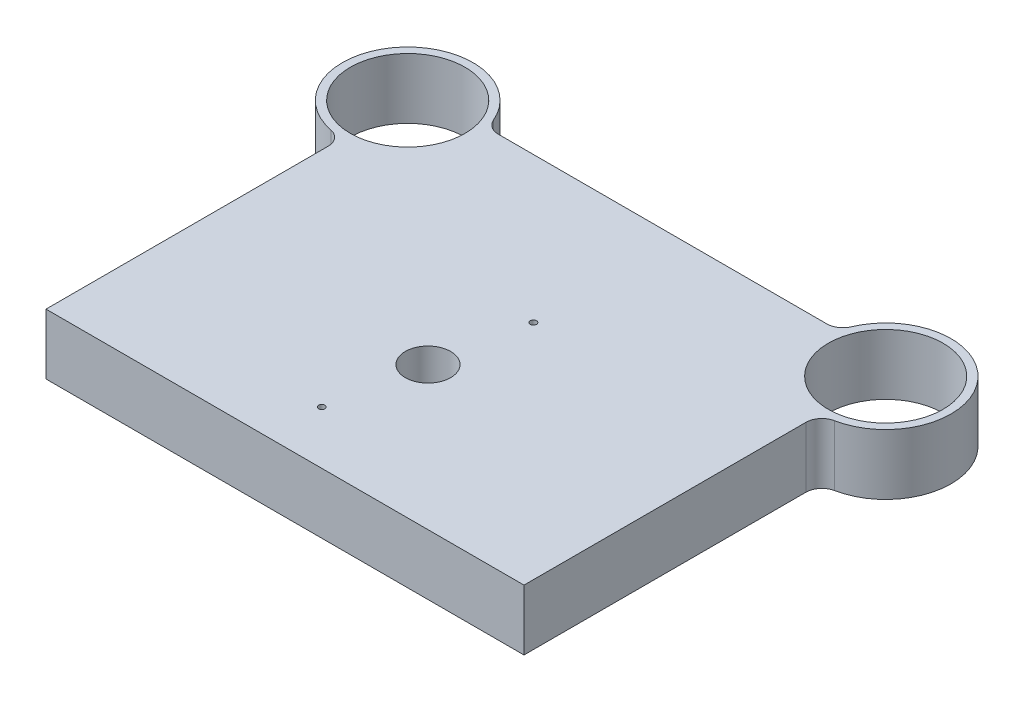
ISO-10303-21;
HEADER;
FILE_DESCRIPTION(('STEP AP214'),'2;1');
FILE_NAME('part.step','',(''),(''),'','','');
FILE_SCHEMA(('AUTOMOTIVE_DESIGN { 1 0 10303 214 1 1 1 1 }'));
ENDSEC;
DATA;
#1=APPLICATION_CONTEXT('core data for automotive mechanical design processes');
#2=APPLICATION_PROTOCOL_DEFINITION('international standard','automotive_design',2000,#1);
#3=PRODUCT_CONTEXT('',#1,'mechanical');
#4=PRODUCT('Part','Part','',(#3));
#5=PRODUCT_RELATED_PRODUCT_CATEGORY('part','',(#4));
#6=PRODUCT_DEFINITION_FORMATION('','',#4);
#7=PRODUCT_DEFINITION_CONTEXT('part definition',#1,'design');
#8=PRODUCT_DEFINITION('design','',#6,#7);
#9=PRODUCT_DEFINITION_SHAPE('','',#8);
#10=(LENGTH_UNIT() NAMED_UNIT(*) SI_UNIT(.MILLI.,.METRE.));
#11=(NAMED_UNIT(*) PLANE_ANGLE_UNIT() SI_UNIT($,.RADIAN.));
#12=(NAMED_UNIT(*) SI_UNIT($,.STERADIAN.) SOLID_ANGLE_UNIT());
#13=UNCERTAINTY_MEASURE_WITH_UNIT(LENGTH_MEASURE(1.E-05),#10,'distance_accuracy_value','');
#14=(GEOMETRIC_REPRESENTATION_CONTEXT(3) GLOBAL_UNCERTAINTY_ASSIGNED_CONTEXT((#13)) GLOBAL_UNIT_ASSIGNED_CONTEXT((#10,
#11,#12)) REPRESENTATION_CONTEXT('',''));
#15=CARTESIAN_POINT('',(0.,0.,0.));
#16=DIRECTION('',(0.,0.,1.));
#17=DIRECTION('',(1.,0.,0.));
#18=AXIS2_PLACEMENT_3D('',#15,#16,#17);
#19=CARTESIAN_POINT('',(-150.,38.,-227.));
#20=DIRECTION('',(0.,1.,0.));
#21=DIRECTION('',(0.,0.,1.));
#22=AXIS2_PLACEMENT_3D('',#19,#20,#21);
#23=PLANE('',#22);
#24=CARTESIAN_POINT('',(0.,38.,-89.74));
#25=DIRECTION('',(0.,1.,0.));
#26=DIRECTION('',(0.,0.,1.));
#27=AXIS2_PLACEMENT_3D('',#24,#25,#26);
#28=CIRCLE('',#27,14.25);
#29=CARTESIAN_POINT('',(0.,38.,-75.49));
#30=VERTEX_POINT('',#29);
#31=EDGE_CURVE('E384',#30,#30,#28,.T.);
#32=ORIENTED_EDGE('',*,*,#31,.F.);
#33=EDGE_LOOP('',(#32));
#34=FACE_BOUND('',#33,.T.);
#35=CARTESIAN_POINT('',(-10.25,38.,-33.3));
#36=DIRECTION('',(0.,1.,0.));
#37=DIRECTION('',(0.,0.,1.));
#38=AXIS2_PLACEMENT_3D('',#35,#36,#37);
#39=CIRCLE('',#38,1.99);
#40=CARTESIAN_POINT('',(-10.25,38.,-31.31));
#41=VERTEX_POINT('',#40);
#42=EDGE_CURVE('E164',#41,#41,#39,.T.);
#43=ORIENTED_EDGE('',*,*,#42,.F.);
#44=EDGE_LOOP('',(#43));
#45=FACE_BOUND('',#44,.T.);
#46=CARTESIAN_POINT('',(10.25,38.,-145.68));
#47=DIRECTION('',(0.,1.,0.));
#48=DIRECTION('',(0.,0.,1.));
#49=AXIS2_PLACEMENT_3D('',#46,#47,#48);
#50=CIRCLE('',#49,1.99000000000003);
#51=CARTESIAN_POINT('',(10.25,38.,-143.69));
#52=VERTEX_POINT('',#51);
#53=EDGE_CURVE('E159',#52,#52,#50,.T.);
#54=ORIENTED_EDGE('',*,*,#53,.F.);
#55=EDGE_LOOP('',(#54));
#56=FACE_BOUND('',#55,.T.);
#57=CARTESIAN_POINT('',(-150.,38.,-227.));
#58=DIRECTION('',(0.,1.,0.));
#59=DIRECTION('',(0.,0.,1.));
#60=AXIS2_PLACEMENT_3D('',#57,#58,#59);
#61=CIRCLE('',#60,36.);
#62=CARTESIAN_POINT('',(-150.,38.,-191.));
#63=VERTEX_POINT('',#62);
#64=EDGE_CURVE('E178',#63,#63,#61,.T.);
#65=ORIENTED_EDGE('',*,*,#64,.F.);
#66=EDGE_LOOP('',(#65));
#67=FACE_BOUND('',#66,.T.);
#68=CARTESIAN_POINT('',(-150.,38.,-227.));
#69=DIRECTION('',(0.,1.,0.));
#70=DIRECTION('',(0.,0.,1.));
#71=AXIS2_PLACEMENT_3D('',#68,#69,#70);
#72=CIRCLE('',#71,41.);
#73=CARTESIAN_POINT('',(-112.284167189385,38.,-243.078431372549));
#74=VERTEX_POINT('',#73);
#75=CARTESIAN_POINT('',(-158.039215686275,38.,-186.795883156702));
#76=VERTEX_POINT('',#75);
#77=EDGE_CURVE('E196',#74,#76,#72,.T.);
#78=ORIENTED_EDGE('',*,*,#77,.T.);
#79=CARTESIAN_POINT('',(-160.,38.,-176.9900009998));
#80=DIRECTION('',(0.,1.,0.));
#81=DIRECTION('',(0.,0.,1.));
#82=AXIS2_PLACEMENT_3D('',#79,#80,#81);
#83=CIRCLE('',#82,10.);
#84=CARTESIAN_POINT('',(-150.,38.,-176.9900009998));
#85=VERTEX_POINT('',#84);
#86=EDGE_CURVE('E243',#76,#85,#83,.F.);
#87=ORIENTED_EDGE('',*,*,#86,.T.);
#88=DIRECTION('',(0.,0.,1.));
#89=VECTOR('',#88,1.);
#90=CARTESIAN_POINT('',(-150.,38.,0.));
#91=LINE('',#90,#89);
#92=CARTESIAN_POINT('',(-150.,38.,0.));
#93=VERTEX_POINT('',#92);
#94=EDGE_CURVE('E184',#85,#93,#91,.T.);
#95=ORIENTED_EDGE('',*,*,#94,.T.);
#96=DIRECTION('',(1.,0.,0.));
#97=VECTOR('',#96,1.);
#98=CARTESIAN_POINT('',(150.,38.,0.));
#99=LINE('',#98,#97);
#100=CARTESIAN_POINT('',(150.,38.,0.));
#101=VERTEX_POINT('',#100);
#102=EDGE_CURVE('E186',#93,#101,#99,.T.);
#103=ORIENTED_EDGE('',*,*,#102,.T.);
#104=DIRECTION('',(0.,0.,-1.));
#105=VECTOR('',#104,1.);
#106=CARTESIAN_POINT('',(150.,38.,0.));
#107=LINE('',#106,#105);
#108=CARTESIAN_POINT('',(150.,38.,-176.9900009998));
#109=VERTEX_POINT('',#108);
#110=EDGE_CURVE('E189',#101,#109,#107,.T.);
#111=ORIENTED_EDGE('',*,*,#110,.T.);
#112=CARTESIAN_POINT('',(160.,38.,-176.9900009998));
#113=DIRECTION('',(0.,1.,0.));
#114=DIRECTION('',(0.,0.,1.));
#115=AXIS2_PLACEMENT_3D('',#112,#113,#114);
#116=CIRCLE('',#115,10.);
#117=CARTESIAN_POINT('',(158.039215686275,38.,-186.795883156702));
#118=VERTEX_POINT('',#117);
#119=EDGE_CURVE('E239',#109,#118,#116,.F.);
#120=ORIENTED_EDGE('',*,*,#119,.T.);
#121=CARTESIAN_POINT('',(150.,38.,-227.));
#122=DIRECTION('',(0.,1.,0.));
#123=DIRECTION('',(0.,0.,-1.));
#124=AXIS2_PLACEMENT_3D('',#121,#122,#123);
#125=CIRCLE('',#124,41.);
#126=CARTESIAN_POINT('',(112.284167189385,38.,-243.078431372549));
#127=VERTEX_POINT('',#126);
#128=EDGE_CURVE('E192',#118,#127,#125,.T.);
#129=ORIENTED_EDGE('',*,*,#128,.T.);
#130=CARTESIAN_POINT('',(103.08518357704,38.,-247.));
#131=DIRECTION('',(0.,1.,0.));
#132=DIRECTION('',(0.,0.,1.));
#133=AXIS2_PLACEMENT_3D('',#130,#131,#132);
#134=CIRCLE('',#133,10.);
#135=CARTESIAN_POINT('',(103.08518357704,38.,-237.));
#136=VERTEX_POINT('',#135);
#137=EDGE_CURVE('E59',#127,#136,#134,.F.);
#138=ORIENTED_EDGE('',*,*,#137,.T.);
#139=DIRECTION('',(-1.,0.,0.));
#140=VECTOR('',#139,1.);
#141=CARTESIAN_POINT('',(110.238209295858,38.,-237.));
#142=LINE('',#141,#140);
#143=CARTESIAN_POINT('',(-103.08518357704,38.,-237.));
#144=VERTEX_POINT('',#143);
#145=EDGE_CURVE('E194',#136,#144,#142,.T.);
#146=ORIENTED_EDGE('',*,*,#145,.T.);
#147=CARTESIAN_POINT('',(-103.08518357704,38.,-247.));
#148=DIRECTION('',(0.,1.,0.));
#149=DIRECTION('',(0.,0.,1.));
#150=AXIS2_PLACEMENT_3D('',#147,#148,#149);
#151=CIRCLE('',#150,10.);
#152=EDGE_CURVE('E11',#144,#74,#151,.F.);
#153=ORIENTED_EDGE('',*,*,#152,.T.);
#154=EDGE_LOOP('',(#78,#87,#95,#103,#111,#120,#129,#138,#146,#153));
#155=FACE_BOUND('',#154,.T.);
#156=CARTESIAN_POINT('',(150.,38.,-227.));
#157=DIRECTION('',(0.,1.,0.));
#158=DIRECTION('',(0.,0.,-1.));
#159=AXIS2_PLACEMENT_3D('',#156,#157,#158);
#160=CIRCLE('',#159,36.);
#161=CARTESIAN_POINT('',(150.,38.,-263.));
#162=VERTEX_POINT('',#161);
#163=EDGE_CURVE('E172',#162,#162,#160,.T.);
#164=ORIENTED_EDGE('',*,*,#163,.F.);
#165=EDGE_LOOP('',(#164));
#166=FACE_BOUND('',#165,.T.);
#167=ADVANCED_FACE('F36',(#34,#45,#56,#67,#155,#166),#23,.T.);
#168=CARTESIAN_POINT('',(-150.,0.,-227.));
#169=DIRECTION('',(0.,1.,0.));
#170=DIRECTION('',(0.,0.,1.));
#171=AXIS2_PLACEMENT_3D('',#168,#169,#170);
#172=PLANE('',#171);
#173=CARTESIAN_POINT('',(0.,0.,-89.74));
#174=DIRECTION('',(0.,1.,0.));
#175=DIRECTION('',(0.,0.,1.));
#176=AXIS2_PLACEMENT_3D('',#173,#174,#175);
#177=CIRCLE('',#176,0.935764141195891);
#178=CARTESIAN_POINT('',(0.,0.,-88.8042358588041));
#179=VERTEX_POINT('',#178);
#180=EDGE_CURVE('E40',#179,#179,#177,.T.);
#181=ORIENTED_EDGE('',*,*,#180,.T.);
#182=EDGE_LOOP('',(#181));
#183=FACE_BOUND('',#182,.T.);
#184=CARTESIAN_POINT('',(-42.25,0.,-145.68));
#185=DIRECTION('',(0.,-1.,0.));
#186=DIRECTION('',(0.,0.,-1.));
#187=AXIS2_PLACEMENT_3D('',#184,#185,#186);
#188=CIRCLE('',#187,9.24999999999999);
#189=CARTESIAN_POINT('',(-42.25,0.,-154.93));
#190=VERTEX_POINT('',#189);
#191=EDGE_CURVE('E136',#190,#190,#188,.T.);
#192=ORIENTED_EDGE('',*,*,#191,.F.);
#193=EDGE_LOOP('',(#192));
#194=FACE_BOUND('',#193,.T.);
#195=CARTESIAN_POINT('',(42.25,0.,-145.68));
#196=DIRECTION('',(0.,-1.,0.));
#197=DIRECTION('',(0.,0.,-1.));
#198=AXIS2_PLACEMENT_3D('',#195,#196,#197);
#199=CIRCLE('',#198,9.24999999999999);
#200=CARTESIAN_POINT('',(42.25,0.,-154.93));
#201=VERTEX_POINT('',#200);
#202=EDGE_CURVE('E135',#201,#201,#199,.T.);
#203=ORIENTED_EDGE('',*,*,#202,.F.);
#204=EDGE_LOOP('',(#203));
#205=FACE_BOUND('',#204,.T.);
#206=CARTESIAN_POINT('',(-42.2499999999999,0.,-33.3));
#207=DIRECTION('',(0.,-1.,0.));
#208=DIRECTION('',(0.,0.,-1.));
#209=AXIS2_PLACEMENT_3D('',#206,#207,#208);
#210=CIRCLE('',#209,9.24999999999999);
#211=CARTESIAN_POINT('',(-42.2499999999999,0.,-42.55));
#212=VERTEX_POINT('',#211);
#213=EDGE_CURVE('E147',#212,#212,#210,.T.);
#214=ORIENTED_EDGE('',*,*,#213,.F.);
#215=EDGE_LOOP('',(#214));
#216=FACE_BOUND('',#215,.T.);
#217=CARTESIAN_POINT('',(42.25,0.,-33.3));
#218=DIRECTION('',(0.,-1.,0.));
#219=DIRECTION('',(0.,0.,-1.));
#220=AXIS2_PLACEMENT_3D('',#217,#218,#219);
#221=CIRCLE('',#220,9.24999999999999);
#222=CARTESIAN_POINT('',(42.25,0.,-42.55));
#223=VERTEX_POINT('',#222);
#224=EDGE_CURVE('E153',#223,#223,#221,.T.);
#225=ORIENTED_EDGE('',*,*,#224,.F.);
#226=EDGE_LOOP('',(#225));
#227=FACE_BOUND('',#226,.T.);
#228=CARTESIAN_POINT('',(-10.25,0.,-33.3));
#229=DIRECTION('',(0.,1.,0.));
#230=DIRECTION('',(0.,0.,1.));
#231=AXIS2_PLACEMENT_3D('',#228,#229,#230);
#232=CIRCLE('',#231,1.99);
#233=CARTESIAN_POINT('',(-10.25,0.,-31.31));
#234=VERTEX_POINT('',#233);
#235=EDGE_CURVE('E160',#234,#234,#232,.T.);
#236=ORIENTED_EDGE('',*,*,#235,.T.);
#237=EDGE_LOOP('',(#236));
#238=FACE_BOUND('',#237,.T.);
#239=CARTESIAN_POINT('',(10.25,0.,-145.68));
#240=DIRECTION('',(0.,1.,0.));
#241=DIRECTION('',(0.,0.,1.));
#242=AXIS2_PLACEMENT_3D('',#239,#240,#241);
#243=CIRCLE('',#242,1.99000000000003);
#244=CARTESIAN_POINT('',(10.25,0.,-143.69));
#245=VERTEX_POINT('',#244);
#246=EDGE_CURVE('E167',#245,#245,#243,.T.);
#247=ORIENTED_EDGE('',*,*,#246,.T.);
#248=EDGE_LOOP('',(#247));
#249=FACE_BOUND('',#248,.T.);
#250=DIRECTION('',(0.,0.,1.));
#251=VECTOR('',#250,1.);
#252=CARTESIAN_POINT('',(-150.,0.,0.));
#253=LINE('',#252,#251);
#254=CARTESIAN_POINT('',(-150.,0.,-176.9900009998));
#255=VERTEX_POINT('',#254);
#256=CARTESIAN_POINT('',(-150.,0.,0.));
#257=VERTEX_POINT('',#256);
#258=EDGE_CURVE('E181',#255,#257,#253,.T.);
#259=ORIENTED_EDGE('',*,*,#258,.F.);
#260=CARTESIAN_POINT('',(-160.,0.,-176.9900009998));
#261=DIRECTION('',(0.,1.,0.));
#262=DIRECTION('',(0.,0.,1.));
#263=AXIS2_PLACEMENT_3D('',#260,#261,#262);
#264=CIRCLE('',#263,10.);
#265=CARTESIAN_POINT('',(-158.039215686275,0.,-186.795883156702));
#266=VERTEX_POINT('',#265);
#267=EDGE_CURVE('E241',#255,#266,#264,.T.);
#268=ORIENTED_EDGE('',*,*,#267,.T.);
#269=CARTESIAN_POINT('',(-150.,0.,-227.));
#270=DIRECTION('',(0.,1.,0.));
#271=DIRECTION('',(0.,0.,1.));
#272=AXIS2_PLACEMENT_3D('',#269,#270,#271);
#273=CIRCLE('',#272,41.);
#274=CARTESIAN_POINT('',(-112.284167189385,0.,-243.078431372549));
#275=VERTEX_POINT('',#274);
#276=EDGE_CURVE('E187',#275,#266,#273,.T.);
#277=ORIENTED_EDGE('',*,*,#276,.F.);
#278=CARTESIAN_POINT('',(-103.08518357704,0.,-247.));
#279=DIRECTION('',(0.,1.,0.));
#280=DIRECTION('',(0.,0.,1.));
#281=AXIS2_PLACEMENT_3D('',#278,#279,#280);
#282=CIRCLE('',#281,10.);
#283=CARTESIAN_POINT('',(-103.08518357704,0.,-237.));
#284=VERTEX_POINT('',#283);
#285=EDGE_CURVE('E45',#275,#284,#282,.T.);
#286=ORIENTED_EDGE('',*,*,#285,.T.);
#287=DIRECTION('',(-1.,0.,0.));
#288=VECTOR('',#287,1.);
#289=CARTESIAN_POINT('',(110.238209295858,0.,-237.));
#290=LINE('',#289,#288);
#291=CARTESIAN_POINT('',(103.08518357704,0.,-237.));
#292=VERTEX_POINT('',#291);
#293=EDGE_CURVE('E209',#292,#284,#290,.T.);
#294=ORIENTED_EDGE('',*,*,#293,.F.);
#295=CARTESIAN_POINT('',(103.08518357704,0.,-247.));
#296=DIRECTION('',(0.,1.,0.));
#297=DIRECTION('',(0.,0.,1.));
#298=AXIS2_PLACEMENT_3D('',#295,#296,#297);
#299=CIRCLE('',#298,10.);
#300=CARTESIAN_POINT('',(112.284167189385,0.,-243.078431372549));
#301=VERTEX_POINT('',#300);
#302=EDGE_CURVE('E245',#292,#301,#299,.T.);
#303=ORIENTED_EDGE('',*,*,#302,.T.);
#304=CARTESIAN_POINT('',(150.,0.,-227.));
#305=DIRECTION('',(0.,1.,0.));
#306=DIRECTION('',(0.,0.,-1.));
#307=AXIS2_PLACEMENT_3D('',#304,#305,#306);
#308=CIRCLE('',#307,41.);
#309=CARTESIAN_POINT('',(158.039215686275,0.,-186.795883156702));
#310=VERTEX_POINT('',#309);
#311=EDGE_CURVE('E206',#310,#301,#308,.T.);
#312=ORIENTED_EDGE('',*,*,#311,.F.);
#313=CARTESIAN_POINT('',(160.,0.,-176.9900009998));
#314=DIRECTION('',(0.,1.,0.));
#315=DIRECTION('',(0.,0.,1.));
#316=AXIS2_PLACEMENT_3D('',#313,#314,#315);
#317=CIRCLE('',#316,10.);
#318=CARTESIAN_POINT('',(150.,0.,-176.9900009998));
#319=VERTEX_POINT('',#318);
#320=EDGE_CURVE('E237',#310,#319,#317,.T.);
#321=ORIENTED_EDGE('',*,*,#320,.T.);
#322=DIRECTION('',(0.,0.,-1.));
#323=VECTOR('',#322,1.);
#324=CARTESIAN_POINT('',(150.,0.,0.));
#325=LINE('',#324,#323);
#326=CARTESIAN_POINT('',(150.,0.,0.));
#327=VERTEX_POINT('',#326);
#328=EDGE_CURVE('E203',#327,#319,#325,.T.);
#329=ORIENTED_EDGE('',*,*,#328,.F.);
#330=DIRECTION('',(1.,0.,0.));
#331=VECTOR('',#330,1.);
#332=CARTESIAN_POINT('',(150.,0.,0.));
#333=LINE('',#332,#331);
#334=EDGE_CURVE('E201',#257,#327,#333,.T.);
#335=ORIENTED_EDGE('',*,*,#334,.F.);
#336=EDGE_LOOP('',(#259,#268,#277,#286,#294,#303,#312,#321,#329,#335));
#337=FACE_BOUND('',#336,.T.);
#338=CARTESIAN_POINT('',(-150.,0.,-227.));
#339=DIRECTION('',(0.,1.,0.));
#340=DIRECTION('',(0.,0.,1.));
#341=AXIS2_PLACEMENT_3D('',#338,#339,#340);
#342=CIRCLE('',#341,36.);
#343=CARTESIAN_POINT('',(-150.,0.,-191.));
#344=VERTEX_POINT('',#343);
#345=EDGE_CURVE('E175',#344,#344,#342,.T.);
#346=ORIENTED_EDGE('',*,*,#345,.T.);
#347=EDGE_LOOP('',(#346));
#348=FACE_BOUND('',#347,.T.);
#349=CARTESIAN_POINT('',(150.,0.,-227.));
#350=DIRECTION('',(0.,1.,0.));
#351=DIRECTION('',(0.,0.,-1.));
#352=AXIS2_PLACEMENT_3D('',#349,#350,#351);
#353=CIRCLE('',#352,36.);
#354=CARTESIAN_POINT('',(150.,0.,-263.));
#355=VERTEX_POINT('',#354);
#356=EDGE_CURVE('E163',#355,#355,#353,.T.);
#357=ORIENTED_EDGE('',*,*,#356,.T.);
#358=EDGE_LOOP('',(#357));
#359=FACE_BOUND('',#358,.T.);
#360=ADVANCED_FACE('F252',(#183,#194,#205,#216,#227,#238,#249,#337,#348,#359),#172,.F.);
#361=CARTESIAN_POINT('',(-150.,38.,0.));
#362=DIRECTION('',(1.,0.,0.));
#363=DIRECTION('',(0.,0.,-1.));
#364=AXIS2_PLACEMENT_3D('',#361,#362,#363);
#365=PLANE('',#364);
#366=ORIENTED_EDGE('',*,*,#94,.F.);
#367=DIRECTION('',(0.,1.,0.));
#368=VECTOR('',#367,1.);
#369=CARTESIAN_POINT('',(-150.,0.,-176.9900009998));
#370=LINE('',#369,#368);
#371=EDGE_CURVE('E225',#85,#255,#370,.F.);
#372=ORIENTED_EDGE('',*,*,#371,.T.);
#373=ORIENTED_EDGE('',*,*,#258,.T.);
#374=DIRECTION('',(0.,-1.,0.));
#375=VECTOR('',#374,1.);
#376=CARTESIAN_POINT('',(-150.,38.,0.));
#377=LINE('',#376,#375);
#378=EDGE_CURVE('E215',#93,#257,#377,.T.);
#379=ORIENTED_EDGE('',*,*,#378,.F.);
#380=EDGE_LOOP('',(#366,#372,#373,#379));
#381=FACE_BOUND('',#380,.T.);
#382=ADVANCED_FACE('F272',(#381),#365,.F.);
#383=CARTESIAN_POINT('',(150.,38.,0.));
#384=DIRECTION('',(0.,0.,-1.));
#385=DIRECTION('',(-1.,0.,0.));
#386=AXIS2_PLACEMENT_3D('',#383,#384,#385);
#387=PLANE('',#386);
#388=ORIENTED_EDGE('',*,*,#334,.T.);
#389=DIRECTION('',(0.,-1.,0.));
#390=VECTOR('',#389,1.);
#391=CARTESIAN_POINT('',(150.,38.,0.));
#392=LINE('',#391,#390);
#393=EDGE_CURVE('E199',#101,#327,#392,.T.);
#394=ORIENTED_EDGE('',*,*,#393,.F.);
#395=ORIENTED_EDGE('',*,*,#102,.F.);
#396=ORIENTED_EDGE('',*,*,#378,.T.);
#397=EDGE_LOOP('',(#388,#394,#395,#396));
#398=FACE_BOUND('',#397,.T.);
#399=ADVANCED_FACE('F275',(#398),#387,.F.);
#400=CARTESIAN_POINT('',(150.,38.,0.));
#401=DIRECTION('',(-1.,0.,0.));
#402=DIRECTION('',(0.,0.,1.));
#403=AXIS2_PLACEMENT_3D('',#400,#401,#402);
#404=PLANE('',#403);
#405=ORIENTED_EDGE('',*,*,#328,.T.);
#406=DIRECTION('',(0.,1.,0.));
#407=VECTOR('',#406,1.);
#408=CARTESIAN_POINT('',(150.,38.,-176.9900009998));
#409=LINE('',#408,#407);
#410=EDGE_CURVE('E223',#319,#109,#409,.T.);
#411=ORIENTED_EDGE('',*,*,#410,.T.);
#412=ORIENTED_EDGE('',*,*,#110,.F.);
#413=ORIENTED_EDGE('',*,*,#393,.T.);
#414=EDGE_LOOP('',(#405,#411,#412,#413));
#415=FACE_BOUND('',#414,.T.);
#416=ADVANCED_FACE('F319',(#415),#404,.F.);
#417=CARTESIAN_POINT('',(150.,38.,-227.));
#418=DIRECTION('',(0.,-1.,0.));
#419=DIRECTION('',(0.,0.,-1.));
#420=AXIS2_PLACEMENT_3D('',#417,#418,#419);
#421=CYLINDRICAL_SURFACE('',#420,41.);
#422=ORIENTED_EDGE('',*,*,#128,.F.);
#423=DIRECTION('',(0.,-1.,0.));
#424=VECTOR('',#423,1.);
#425=CARTESIAN_POINT('',(158.039215686275,38.,-186.795883156702));
#426=LINE('',#425,#424);
#427=EDGE_CURVE('E220',#118,#310,#426,.T.);
#428=ORIENTED_EDGE('',*,*,#427,.T.);
#429=ORIENTED_EDGE('',*,*,#311,.T.);
#430=DIRECTION('',(0.,-1.,0.));
#431=VECTOR('',#430,1.);
#432=CARTESIAN_POINT('',(112.284167189385,38.,-243.078431372549));
#433=LINE('',#432,#431);
#434=EDGE_CURVE('E218',#301,#127,#433,.F.);
#435=ORIENTED_EDGE('',*,*,#434,.T.);
#436=EDGE_LOOP('',(#422,#428,#429,#435));
#437=FACE_BOUND('',#436,.T.);
#438=ADVANCED_FACE('F287',(#437),#421,.T.);
#439=CARTESIAN_POINT('',(110.238209295858,38.,-237.));
#440=DIRECTION('',(0.,0.,1.));
#441=DIRECTION('',(1.,0.,0.));
#442=AXIS2_PLACEMENT_3D('',#439,#440,#441);
#443=PLANE('',#442);
#444=ORIENTED_EDGE('',*,*,#145,.F.);
#445=DIRECTION('',(0.,1.,0.));
#446=VECTOR('',#445,1.);
#447=CARTESIAN_POINT('',(103.08518357704,0.,-237.));
#448=LINE('',#447,#446);
#449=EDGE_CURVE('E234',#136,#292,#448,.F.);
#450=ORIENTED_EDGE('',*,*,#449,.T.);
#451=ORIENTED_EDGE('',*,*,#293,.T.);
#452=DIRECTION('',(0.,1.,0.));
#453=VECTOR('',#452,1.);
#454=CARTESIAN_POINT('',(-103.08518357704,38.,-237.));
#455=LINE('',#454,#453);
#456=EDGE_CURVE('E52',#284,#144,#455,.T.);
#457=ORIENTED_EDGE('',*,*,#456,.T.);
#458=EDGE_LOOP('',(#444,#450,#451,#457));
#459=FACE_BOUND('',#458,.T.);
#460=ADVANCED_FACE('F256',(#459),#443,.F.);
#461=CARTESIAN_POINT('',(-150.,38.,-227.));
#462=DIRECTION('',(0.,-1.,0.));
#463=DIRECTION('',(0.,0.,-1.));
#464=AXIS2_PLACEMENT_3D('',#461,#462,#463);
#465=CYLINDRICAL_SURFACE('',#464,41.);
#466=ORIENTED_EDGE('',*,*,#276,.T.);
#467=DIRECTION('',(0.,-1.,0.));
#468=VECTOR('',#467,1.);
#469=CARTESIAN_POINT('',(-158.039215686275,38.,-186.795883156702));
#470=LINE('',#469,#468);
#471=EDGE_CURVE('E231',#266,#76,#470,.F.);
#472=ORIENTED_EDGE('',*,*,#471,.T.);
#473=ORIENTED_EDGE('',*,*,#77,.F.);
#474=DIRECTION('',(0.,-1.,0.));
#475=VECTOR('',#474,1.);
#476=CARTESIAN_POINT('',(-112.284167189385,38.,-243.078431372549));
#477=LINE('',#476,#475);
#478=EDGE_CURVE('E228',#74,#275,#477,.T.);
#479=ORIENTED_EDGE('',*,*,#478,.T.);
#480=EDGE_LOOP('',(#466,#472,#473,#479));
#481=FACE_BOUND('',#480,.T.);
#482=ADVANCED_FACE('F263',(#481),#465,.T.);
#483=CARTESIAN_POINT('',(-150.,38.,-227.));
#484=DIRECTION('',(0.,-1.,0.));
#485=DIRECTION('',(0.,0.,-1.));
#486=AXIS2_PLACEMENT_3D('',#483,#484,#485);
#487=CYLINDRICAL_SURFACE('',#486,36.);
#488=ORIENTED_EDGE('',*,*,#64,.T.);
#489=EDGE_LOOP('',(#488));
#490=FACE_BOUND('',#489,.T.);
#491=ORIENTED_EDGE('',*,*,#345,.F.);
#492=EDGE_LOOP('',(#491));
#493=FACE_BOUND('',#492,.T.);
#494=ADVANCED_FACE('F310',(#490,#493),#487,.F.);
#495=CARTESIAN_POINT('',(150.,38.,-227.));
#496=DIRECTION('',(0.,-1.,0.));
#497=DIRECTION('',(0.,0.,-1.));
#498=AXIS2_PLACEMENT_3D('',#495,#496,#497);
#499=CYLINDRICAL_SURFACE('',#498,36.);
#500=ORIENTED_EDGE('',*,*,#163,.T.);
#501=EDGE_LOOP('',(#500));
#502=FACE_BOUND('',#501,.T.);
#503=ORIENTED_EDGE('',*,*,#356,.F.);
#504=EDGE_LOOP('',(#503));
#505=FACE_BOUND('',#504,.T.);
#506=ADVANCED_FACE('F327',(#502,#505),#499,.F.);
#507=CARTESIAN_POINT('',(160.,38.,-176.9900009998));
#508=DIRECTION('',(0.,-1.,0.));
#509=DIRECTION('',(0.,0.,-1.));
#510=AXIS2_PLACEMENT_3D('',#507,#508,#509);
#511=CYLINDRICAL_SURFACE('',#510,10.);
#512=ORIENTED_EDGE('',*,*,#119,.F.);
#513=ORIENTED_EDGE('',*,*,#410,.F.);
#514=ORIENTED_EDGE('',*,*,#320,.F.);
#515=ORIENTED_EDGE('',*,*,#427,.F.);
#516=EDGE_LOOP('',(#512,#513,#514,#515));
#517=FACE_BOUND('',#516,.T.);
#518=ADVANCED_FACE('F284',(#517),#511,.F.);
#519=CARTESIAN_POINT('',(-160.,38.,-176.9900009998));
#520=DIRECTION('',(0.,-1.,0.));
#521=DIRECTION('',(0.,0.,-1.));
#522=AXIS2_PLACEMENT_3D('',#519,#520,#521);
#523=CYLINDRICAL_SURFACE('',#522,10.);
#524=ORIENTED_EDGE('',*,*,#86,.F.);
#525=ORIENTED_EDGE('',*,*,#471,.F.);
#526=ORIENTED_EDGE('',*,*,#267,.F.);
#527=ORIENTED_EDGE('',*,*,#371,.F.);
#528=EDGE_LOOP('',(#524,#525,#526,#527));
#529=FACE_BOUND('',#528,.T.);
#530=ADVANCED_FACE('F266',(#529),#523,.F.);
#531=CARTESIAN_POINT('',(103.08518357704,38.,-247.));
#532=DIRECTION('',(0.,-1.,0.));
#533=DIRECTION('',(0.,0.,-1.));
#534=AXIS2_PLACEMENT_3D('',#531,#532,#533);
#535=CYLINDRICAL_SURFACE('',#534,10.);
#536=ORIENTED_EDGE('',*,*,#137,.F.);
#537=ORIENTED_EDGE('',*,*,#434,.F.);
#538=ORIENTED_EDGE('',*,*,#302,.F.);
#539=ORIENTED_EDGE('',*,*,#449,.F.);
#540=EDGE_LOOP('',(#536,#537,#538,#539));
#541=FACE_BOUND('',#540,.T.);
#542=ADVANCED_FACE('F291',(#541),#535,.F.);
#543=CARTESIAN_POINT('',(-103.08518357704,38.,-247.));
#544=DIRECTION('',(0.,-1.,0.));
#545=DIRECTION('',(0.,0.,-1.));
#546=AXIS2_PLACEMENT_3D('',#543,#544,#545);
#547=CYLINDRICAL_SURFACE('',#546,10.);
#548=ORIENTED_EDGE('',*,*,#152,.F.);
#549=ORIENTED_EDGE('',*,*,#456,.F.);
#550=ORIENTED_EDGE('',*,*,#285,.F.);
#551=ORIENTED_EDGE('',*,*,#478,.F.);
#552=EDGE_LOOP('',(#548,#549,#550,#551));
#553=FACE_BOUND('',#552,.T.);
#554=ADVANCED_FACE('F38',(#553),#547,.F.);
#555=CARTESIAN_POINT('',(10.25,0.,-145.68));
#556=DIRECTION('',(0.,1.,0.));
#557=DIRECTION('',(0.,0.,1.));
#558=AXIS2_PLACEMENT_3D('',#555,#556,#557);
#559=CYLINDRICAL_SURFACE('',#558,1.99000000000003);
#560=ORIENTED_EDGE('',*,*,#246,.F.);
#561=EDGE_LOOP('',(#560));
#562=FACE_BOUND('',#561,.T.);
#563=ORIENTED_EDGE('',*,*,#53,.T.);
#564=EDGE_LOOP('',(#563));
#565=FACE_BOUND('',#564,.T.);
#566=ADVANCED_FACE('F297',(#562,#565),#559,.F.);
#567=CARTESIAN_POINT('',(-10.25,0.,-33.3));
#568=DIRECTION('',(0.,1.,0.));
#569=DIRECTION('',(0.,0.,1.));
#570=AXIS2_PLACEMENT_3D('',#567,#568,#569);
#571=CYLINDRICAL_SURFACE('',#570,1.99);
#572=ORIENTED_EDGE('',*,*,#235,.F.);
#573=EDGE_LOOP('',(#572));
#574=FACE_BOUND('',#573,.T.);
#575=ORIENTED_EDGE('',*,*,#42,.T.);
#576=EDGE_LOOP('',(#575));
#577=FACE_BOUND('',#576,.T.);
#578=ADVANCED_FACE('F340',(#574,#577),#571,.F.);
#579=CARTESIAN_POINT('',(42.25,30.,-33.3));
#580=DIRECTION('',(0.,-1.,0.));
#581=DIRECTION('',(0.,0.,-1.));
#582=AXIS2_PLACEMENT_3D('',#579,#580,#581);
#583=CONICAL_SURFACE('',#582,9.24999999999999,1.02974425867665);
#584=CARTESIAN_POINT('',(42.25,35.5579607260049,-33.3));
#585=VERTEX_POINT('',#584);
#586=VERTEX_LOOP('',#585);
#587=FACE_BOUND('',#586,.T.);
#588=CARTESIAN_POINT('',(42.25,30.,-33.3));
#589=DIRECTION('',(0.,-1.,0.));
#590=DIRECTION('',(0.,0.,-1.));
#591=AXIS2_PLACEMENT_3D('',#588,#589,#590);
#592=CIRCLE('',#591,9.24999999999999);
#593=CARTESIAN_POINT('',(42.25,30.,-42.55));
#594=VERTEX_POINT('',#593);
#595=EDGE_CURVE('E156',#594,#594,#592,.T.);
#596=ORIENTED_EDGE('',*,*,#595,.T.);
#597=EDGE_LOOP('',(#596));
#598=FACE_BOUND('',#597,.T.);
#599=ADVANCED_FACE('F344',(#587,#598),#583,.F.);
#600=CARTESIAN_POINT('',(42.25,0.,-33.3));
#601=DIRECTION('',(0.,-1.,0.));
#602=DIRECTION('',(0.,0.,-1.));
#603=AXIS2_PLACEMENT_3D('',#600,#601,#602);
#604=CYLINDRICAL_SURFACE('',#603,9.24999999999999);
#605=ORIENTED_EDGE('',*,*,#595,.F.);
#606=EDGE_LOOP('',(#605));
#607=FACE_BOUND('',#606,.T.);
#608=ORIENTED_EDGE('',*,*,#224,.T.);
#609=EDGE_LOOP('',(#608));
#610=FACE_BOUND('',#609,.T.);
#611=ADVANCED_FACE('F348',(#607,#610),#604,.F.);
#612=CARTESIAN_POINT('',(-42.2499999999999,30.,-33.3));
#613=DIRECTION('',(0.,-1.,0.));
#614=DIRECTION('',(0.,0.,-1.));
#615=AXIS2_PLACEMENT_3D('',#612,#613,#614);
#616=CONICAL_SURFACE('',#615,9.24999999999999,1.02974425867665);
#617=CARTESIAN_POINT('',(-42.25,35.5579607260049,-33.3));
#618=VERTEX_POINT('',#617);
#619=VERTEX_LOOP('',#618);
#620=FACE_BOUND('',#619,.T.);
#621=CARTESIAN_POINT('',(-42.2499999999999,30.,-33.3));
#622=DIRECTION('',(0.,-1.,0.));
#623=DIRECTION('',(0.,0.,-1.));
#624=AXIS2_PLACEMENT_3D('',#621,#622,#623);
#625=CIRCLE('',#624,9.24999999999999);
#626=CARTESIAN_POINT('',(-42.2499999999999,30.,-42.55));
#627=VERTEX_POINT('',#626);
#628=EDGE_CURVE('E150',#627,#627,#625,.T.);
#629=ORIENTED_EDGE('',*,*,#628,.T.);
#630=EDGE_LOOP('',(#629));
#631=FACE_BOUND('',#630,.T.);
#632=ADVANCED_FACE('F352',(#620,#631),#616,.F.);
#633=CARTESIAN_POINT('',(-42.2499999999999,0.,-33.3));
#634=DIRECTION('',(0.,-1.,0.));
#635=DIRECTION('',(0.,0.,-1.));
#636=AXIS2_PLACEMENT_3D('',#633,#634,#635);
#637=CYLINDRICAL_SURFACE('',#636,9.24999999999999);
#638=ORIENTED_EDGE('',*,*,#628,.F.);
#639=EDGE_LOOP('',(#638));
#640=FACE_BOUND('',#639,.T.);
#641=ORIENTED_EDGE('',*,*,#213,.T.);
#642=EDGE_LOOP('',(#641));
#643=FACE_BOUND('',#642,.T.);
#644=ADVANCED_FACE('F356',(#640,#643),#637,.F.);
#645=CARTESIAN_POINT('',(42.25,30.,-145.68));
#646=DIRECTION('',(0.,-1.,0.));
#647=DIRECTION('',(0.,0.,-1.));
#648=AXIS2_PLACEMENT_3D('',#645,#646,#647);
#649=CONICAL_SURFACE('',#648,9.24999999999999,1.02974425867665);
#650=CARTESIAN_POINT('',(42.25,35.5579607260049,-145.68));
#651=VERTEX_POINT('',#650);
#652=VERTEX_LOOP('',#651);
#653=FACE_BOUND('',#652,.T.);
#654=CARTESIAN_POINT('',(42.25,30.,-145.68));
#655=DIRECTION('',(0.,-1.,0.));
#656=DIRECTION('',(0.,0.,-1.));
#657=AXIS2_PLACEMENT_3D('',#654,#655,#656);
#658=CIRCLE('',#657,9.24999999999999);
#659=CARTESIAN_POINT('',(42.25,30.,-154.93));
#660=VERTEX_POINT('',#659);
#661=EDGE_CURVE('E139',#660,#660,#658,.T.);
#662=ORIENTED_EDGE('',*,*,#661,.T.);
#663=EDGE_LOOP('',(#662));
#664=FACE_BOUND('',#663,.T.);
#665=ADVANCED_FACE('F360',(#653,#664),#649,.F.);
#666=CARTESIAN_POINT('',(42.25,0.,-145.68));
#667=DIRECTION('',(0.,-1.,0.));
#668=DIRECTION('',(0.,0.,-1.));
#669=AXIS2_PLACEMENT_3D('',#666,#667,#668);
#670=CYLINDRICAL_SURFACE('',#669,9.24999999999999);
#671=ORIENTED_EDGE('',*,*,#661,.F.);
#672=EDGE_LOOP('',(#671));
#673=FACE_BOUND('',#672,.T.);
#674=ORIENTED_EDGE('',*,*,#202,.T.);
#675=EDGE_LOOP('',(#674));
#676=FACE_BOUND('',#675,.T.);
#677=ADVANCED_FACE('F129',(#673,#676),#670,.F.);
#678=CARTESIAN_POINT('',(-42.25,30.,-145.68));
#679=DIRECTION('',(0.,-1.,0.));
#680=DIRECTION('',(0.,0.,-1.));
#681=AXIS2_PLACEMENT_3D('',#678,#679,#680);
#682=CONICAL_SURFACE('',#681,9.24999999999999,1.02974425867665);
#683=CARTESIAN_POINT('',(-42.25,35.5579607260049,-145.68));
#684=VERTEX_POINT('',#683);
#685=VERTEX_LOOP('',#684);
#686=FACE_BOUND('',#685,.T.);
#687=CARTESIAN_POINT('',(-42.25,30.,-145.68));
#688=DIRECTION('',(0.,-1.,0.));
#689=DIRECTION('',(0.,0.,-1.));
#690=AXIS2_PLACEMENT_3D('',#687,#688,#689);
#691=CIRCLE('',#690,9.24999999999999);
#692=CARTESIAN_POINT('',(-42.25,30.,-154.93));
#693=VERTEX_POINT('',#692);
#694=EDGE_CURVE('E133',#693,#693,#691,.T.);
#695=ORIENTED_EDGE('',*,*,#694,.T.);
#696=EDGE_LOOP('',(#695));
#697=FACE_BOUND('',#696,.T.);
#698=ADVANCED_FACE('F125',(#686,#697),#682,.F.);
#699=CARTESIAN_POINT('',(-42.25,0.,-145.68));
#700=DIRECTION('',(0.,-1.,0.));
#701=DIRECTION('',(0.,0.,-1.));
#702=AXIS2_PLACEMENT_3D('',#699,#700,#701);
#703=CYLINDRICAL_SURFACE('',#702,9.24999999999999);
#704=ORIENTED_EDGE('',*,*,#694,.F.);
#705=EDGE_LOOP('',(#704));
#706=FACE_BOUND('',#705,.T.);
#707=ORIENTED_EDGE('',*,*,#191,.T.);
#708=EDGE_LOOP('',(#707));
#709=FACE_BOUND('',#708,.T.);
#710=ADVANCED_FACE('F128',(#706,#709),#703,.F.);
#711=CARTESIAN_POINT('',(0.,8.,-89.74));
#712=DIRECTION('',(0.,1.,0.));
#713=DIRECTION('',(0.,0.,1.));
#714=AXIS2_PLACEMENT_3D('',#711,#712,#713);
#715=CONICAL_SURFACE('',#714,14.25,1.02974425867665);
#716=CARTESIAN_POINT('',(0.,8.,-89.74));
#717=DIRECTION('',(0.,1.,0.));
#718=DIRECTION('',(0.,0.,1.));
#719=AXIS2_PLACEMENT_3D('',#716,#717,#718);
#720=CIRCLE('',#719,14.25);
#721=CARTESIAN_POINT('',(0.,8.,-75.49));
#722=VERTEX_POINT('',#721);
#723=EDGE_CURVE('E382',#722,#722,#720,.T.);
#724=ORIENTED_EDGE('',*,*,#723,.T.);
#725=EDGE_LOOP('',(#724));
#726=FACE_BOUND('',#725,.T.);
#727=ORIENTED_EDGE('',*,*,#180,.F.);
#728=EDGE_LOOP('',(#727));
#729=FACE_BOUND('',#728,.T.);
#730=ADVANCED_FACE('F370',(#726,#729),#715,.F.);
#731=CARTESIAN_POINT('',(0.,38.,-89.74));
#732=DIRECTION('',(0.,1.,0.));
#733=DIRECTION('',(0.,0.,1.));
#734=AXIS2_PLACEMENT_3D('',#731,#732,#733);
#735=CYLINDRICAL_SURFACE('',#734,14.25);
#736=ORIENTED_EDGE('',*,*,#723,.F.);
#737=EDGE_LOOP('',(#736));
#738=FACE_BOUND('',#737,.T.);
#739=ORIENTED_EDGE('',*,*,#31,.T.);
#740=EDGE_LOOP('',(#739));
#741=FACE_BOUND('',#740,.T.);
#742=ADVANCED_FACE('F373',(#738,#741),#735,.F.);
#743=CLOSED_SHELL('',(#167,#360,#382,#399,#416,#438,#460,#482,#494,#506,#518,#530,#542,#554,
#566,#578,#599,#611,#632,#644,#665,#677,#698,#710,#730,#742));
#744=MANIFOLD_SOLID_BREP('B2',#743);
#745=ADVANCED_BREP_SHAPE_REPRESENTATION('',(#18,#744),#14);
#746=SHAPE_DEFINITION_REPRESENTATION(#9,#745);
ENDSEC;
END-ISO-10303-21;
